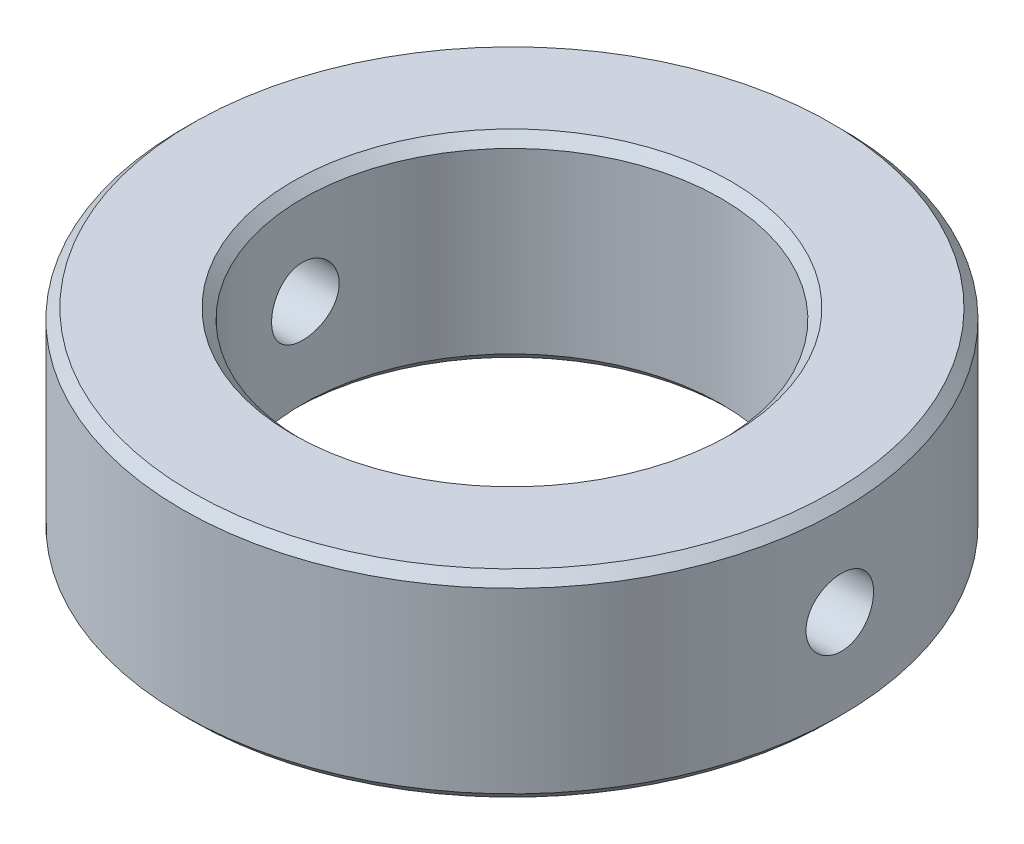
ISO-10303-21;
HEADER;
FILE_DESCRIPTION(('STEP AP214'),'2;1');
FILE_NAME('part.step','',(''),(''),'','','');
FILE_SCHEMA(('AUTOMOTIVE_DESIGN { 1 0 10303 214 1 1 1 1 }'));
ENDSEC;
DATA;
#1=APPLICATION_CONTEXT('core data for automotive mechanical design processes');
#2=APPLICATION_PROTOCOL_DEFINITION('international standard','automotive_design',2000,#1);
#3=PRODUCT_CONTEXT('',#1,'mechanical');
#4=PRODUCT('Part','Part','',(#3));
#5=PRODUCT_RELATED_PRODUCT_CATEGORY('part','',(#4));
#6=PRODUCT_DEFINITION_FORMATION('','',#4);
#7=PRODUCT_DEFINITION_CONTEXT('part definition',#1,'design');
#8=PRODUCT_DEFINITION('design','',#6,#7);
#9=PRODUCT_DEFINITION_SHAPE('','',#8);
#10=(LENGTH_UNIT() NAMED_UNIT(*) SI_UNIT(.MILLI.,.METRE.));
#11=(NAMED_UNIT(*) PLANE_ANGLE_UNIT() SI_UNIT($,.RADIAN.));
#12=(NAMED_UNIT(*) SI_UNIT($,.STERADIAN.) SOLID_ANGLE_UNIT());
#13=UNCERTAINTY_MEASURE_WITH_UNIT(LENGTH_MEASURE(1.E-05),#10,'distance_accuracy_value','');
#14=(GEOMETRIC_REPRESENTATION_CONTEXT(3) GLOBAL_UNCERTAINTY_ASSIGNED_CONTEXT((#13)) GLOBAL_UNIT_ASSIGNED_CONTEXT((#10,
#11,#12)) REPRESENTATION_CONTEXT('',''));
#15=CARTESIAN_POINT('',(0.,0.,0.));
#16=DIRECTION('',(0.,0.,1.));
#17=DIRECTION('',(1.,0.,0.));
#18=AXIS2_PLACEMENT_3D('',#15,#16,#17);
#19=CARTESIAN_POINT('',(0.,6.,0.));
#20=DIRECTION('',(0.,1.,0.));
#21=DIRECTION('',(0.,0.,1.));
#22=AXIS2_PLACEMENT_3D('',#19,#20,#21);
#23=PLANE('',#22);
#24=CARTESIAN_POINT('',(0.,6.,0.));
#25=DIRECTION('',(0.,1.,0.));
#26=DIRECTION('',(0.,0.,1.));
#27=AXIS2_PLACEMENT_3D('',#24,#25,#26);
#28=CIRCLE('',#27,9.7);
#29=CARTESIAN_POINT('',(0.,6.,9.7));
#30=VERTEX_POINT('',#29);
#31=EDGE_CURVE('E12',#30,#30,#28,.T.);
#32=ORIENTED_EDGE('',*,*,#31,.T.);
#33=EDGE_LOOP('',(#32));
#34=FACE_BOUND('',#33,.T.);
#35=CARTESIAN_POINT('',(0.,6.,0.));
#36=DIRECTION('',(0.,1.,0.));
#37=DIRECTION('',(0.,0.,1.));
#38=AXIS2_PLACEMENT_3D('',#35,#36,#37);
#39=CIRCLE('',#38,6.65);
#40=CARTESIAN_POINT('',(0.,6.,6.65));
#41=VERTEX_POINT('',#40);
#42=EDGE_CURVE('E55',#41,#41,#39,.F.);
#43=ORIENTED_EDGE('',*,*,#42,.T.);
#44=EDGE_LOOP('',(#43));
#45=FACE_BOUND('',#44,.T.);
#46=ADVANCED_FACE('F48',(#34,#45),#23,.T.);
#47=CARTESIAN_POINT('',(0.,0.,0.));
#48=DIRECTION('',(0.,1.,0.));
#49=DIRECTION('',(0.,0.,1.));
#50=AXIS2_PLACEMENT_3D('',#47,#48,#49);
#51=PLANE('',#50);
#52=CARTESIAN_POINT('',(0.,0.,0.));
#53=DIRECTION('',(0.,1.,0.));
#54=DIRECTION('',(0.,0.,1.));
#55=AXIS2_PLACEMENT_3D('',#52,#53,#54);
#56=CIRCLE('',#55,6.65);
#57=CARTESIAN_POINT('',(0.,0.,6.65));
#58=VERTEX_POINT('',#57);
#59=EDGE_CURVE('E74',#58,#58,#56,.T.);
#60=ORIENTED_EDGE('',*,*,#59,.T.);
#61=EDGE_LOOP('',(#60));
#62=FACE_BOUND('',#61,.T.);
#63=CARTESIAN_POINT('',(0.,0.,0.));
#64=DIRECTION('',(0.,1.,0.));
#65=DIRECTION('',(0.,0.,1.));
#66=AXIS2_PLACEMENT_3D('',#63,#64,#65);
#67=CIRCLE('',#66,9.7);
#68=CARTESIAN_POINT('',(0.,0.,9.7));
#69=VERTEX_POINT('',#68);
#70=EDGE_CURVE('E77',#69,#69,#67,.F.);
#71=ORIENTED_EDGE('',*,*,#70,.T.);
#72=EDGE_LOOP('',(#71));
#73=FACE_BOUND('',#72,.T.);
#74=ADVANCED_FACE('F121',(#62,#73),#51,.F.);
#75=CARTESIAN_POINT('',(0.,6.,0.));
#76=DIRECTION('',(0.,-1.,0.));
#77=DIRECTION('',(0.,0.,-1.));
#78=AXIS2_PLACEMENT_3D('',#75,#76,#77);
#79=CYLINDRICAL_SURFACE('',#78,10.);
#80=CARTESIAN_POINT('',(0.,0.299999999999995,0.));
#81=DIRECTION('',(0.,1.,0.));
#82=DIRECTION('',(0.,0.,1.));
#83=AXIS2_PLACEMENT_3D('',#80,#81,#82);
#84=CIRCLE('',#83,10.);
#85=CARTESIAN_POINT('',(0.,0.299999999999995,10.));
#86=VERTEX_POINT('',#85);
#87=EDGE_CURVE('E59',#86,#86,#84,.T.);
#88=ORIENTED_EDGE('',*,*,#87,.T.);
#89=EDGE_LOOP('',(#88));
#90=FACE_BOUND('',#89,.T.);
#91=CARTESIAN_POINT('',(0.,5.69999999999999,0.));
#92=DIRECTION('',(0.,1.,0.));
#93=DIRECTION('',(0.,0.,1.));
#94=AXIS2_PLACEMENT_3D('',#91,#92,#93);
#95=CIRCLE('',#94,10.);
#96=CARTESIAN_POINT('',(0.,5.69999999999999,10.));
#97=VERTEX_POINT('',#96);
#98=EDGE_CURVE('E63',#97,#97,#95,.F.);
#99=ORIENTED_EDGE('',*,*,#98,.T.);
#100=EDGE_LOOP('',(#99));
#101=FACE_BOUND('',#100,.T.);
#102=CARTESIAN_POINT('',(-10.,1.97500000000001,0.));
#103=CARTESIAN_POINT('',(-9.99999932441296,1.97500248238028,-0.0574131062054996));
#104=CARTESIAN_POINT('',(-9.99950030929872,1.97984004507992,-0.114863983907446));
#105=CARTESIAN_POINT('',(-9.99755762501469,1.9990647024074,-0.228172445244312));
#106=CARTESIAN_POINT('',(-9.99611292001963,2.0134622684683,-0.284028211643129));
#107=CARTESIAN_POINT('',(-9.99244190777641,2.05138292992313,-0.39248926527767));
#108=CARTESIAN_POINT('',(-9.99021607755955,2.07490045669731,-0.445096513369503));
#109=CARTESIAN_POINT('',(-9.9852315814176,2.1303825244494,-0.545605673014001));
#110=CARTESIAN_POINT('',(-9.98247302015676,2.16234540664414,-0.593508506046438));
#111=CARTESIAN_POINT('',(-9.97672034817429,2.23394018490046,-0.683441035563868));
#112=CARTESIAN_POINT('',(-9.97372547839951,2.27359744506658,-0.725450493185196));
#113=CARTESIAN_POINT('',(-9.96784399214136,2.35940111214278,-0.8022297925499));
#114=CARTESIAN_POINT('',(-9.96495738071386,2.40554782164456,-0.836999296519211));
#115=CARTESIAN_POINT('',(-9.95961151493231,2.50314760483241,-0.898383757314614));
#116=CARTESIAN_POINT('',(-9.95715322902171,2.5546122947672,-0.924980336165677));
#117=CARTESIAN_POINT('',(-9.95295182060713,2.66130666143287,-0.969146617542703));
#118=CARTESIAN_POINT('',(-9.95120867959267,2.71653624067193,-0.986716553713149));
#119=CARTESIAN_POINT('',(-9.9486418257013,2.82898583362562,-1.01227065402806));
#120=CARTESIAN_POINT('',(-9.94781488790261,2.88619813011058,-1.02028844808327));
#121=CARTESIAN_POINT('',(-9.94716407105467,3.00116186434615,-1.02661463441976));
#122=CARTESIAN_POINT('',(-9.94734016438832,3.05891328720893,-1.02492329402893));
#123=CARTESIAN_POINT('',(-9.94867256793449,3.17308387282555,-1.01190693074944));
#124=CARTESIAN_POINT('',(-9.94982513897765,3.22950727497071,-1.00061865626926));
#125=CARTESIAN_POINT('',(-9.95297479225768,3.33965447521571,-0.968786051282914));
#126=CARTESIAN_POINT('',(-9.95497188642203,3.39337823517562,-0.948241590048264));
#127=CARTESIAN_POINT('',(-9.95958986076258,3.4967170428138,-0.898439326613739));
#128=CARTESIAN_POINT('',(-9.96221190412126,3.54632419355445,-0.869165250651661));
#129=CARTESIAN_POINT('',(-9.96778336264656,3.63993519241195,-0.802746430394857));
#130=CARTESIAN_POINT('',(-9.97073278788102,3.68393886811776,-0.76560144401693));
#131=CARTESIAN_POINT('',(-9.97664334256132,3.76530733592978,-0.684290106939165));
#132=CARTESIAN_POINT('',(-9.97960446292742,3.8026404269832,-0.640092024909692));
#133=CARTESIAN_POINT('',(-9.98519187154236,3.86936216732988,-0.546039217664439));
#134=CARTESIAN_POINT('',(-9.98781815938634,3.89875080701734,-0.496184485609196));
#135=CARTESIAN_POINT('',(-9.99244091747177,3.94874825374905,-0.392211383657822));
#136=CARTESIAN_POINT('',(-9.99443726988248,3.96935541845237,-0.338092218453697));
#137=CARTESIAN_POINT('',(-9.99757403288948,4.00118154633689,-0.227137000902652));
#138=CARTESIAN_POINT('',(-9.99871447038201,4.01240080452464,-0.170301033988128));
#139=CARTESIAN_POINT('',(-10.0000074478558,4.02509235067408,-0.0558000710087554));
#140=CARTESIAN_POINT('',(-10.000164420832,4.02660837690576,0.00186002902332531));
#141=CARTESIAN_POINT('',(-9.99948467674765,4.01996535162462,0.11661348570182));
#142=CARTESIAN_POINT('',(-9.99864797380352,4.01180643755709,0.173706850387837));
#143=CARTESIAN_POINT('',(-9.99607772819907,3.98608142390921,0.285579670099533));
#144=CARTESIAN_POINT('',(-9.99434614145257,3.9685358374938,0.340363890840557));
#145=CARTESIAN_POINT('',(-9.99018035076137,3.92455663705304,0.446211523740552));
#146=CARTESIAN_POINT('',(-9.98774613031117,3.89812281423256,0.49727484845701));
#147=CARTESIAN_POINT('',(-9.98243622632233,3.83700926852691,0.594428726742531));
#148=CARTESIAN_POINT('',(-9.97955901906721,3.80230084897839,0.640501144374615));
#149=CARTESIAN_POINT('',(-9.97369079041989,3.72566445094606,0.726181716509853));
#150=CARTESIAN_POINT('',(-9.97069976602537,3.68373628191302,0.765789700344893));
#151=CARTESIAN_POINT('',(-9.96492764170355,3.59365956060607,0.837569245015072));
#152=CARTESIAN_POINT('',(-9.96214737972029,3.54548805140624,0.869712073931628));
#153=CARTESIAN_POINT('',(-9.95712440687486,3.44440512695985,0.925451287834751));
#154=CARTESIAN_POINT('',(-9.95488168834143,3.39149377937019,0.949047794788075));
#155=CARTESIAN_POINT('',(-9.95119300204058,3.28253114524049,0.986976588495294));
#156=CARTESIAN_POINT('',(-9.94974557171028,3.22648583281152,1.00132588964706));
#157=CARTESIAN_POINT('',(-9.94780683072443,3.11276569842616,1.02040811822004));
#158=CARTESIAN_POINT('',(-9.94731549113239,3.05509092583969,1.02514133667631));
#159=CARTESIAN_POINT('',(-9.94734519187248,2.94003464246843,1.02485288529927));
#160=CARTESIAN_POINT('',(-9.94786154813303,2.88265301199357,1.01987634933169));
#161=CARTESIAN_POINT('',(-9.94983846493521,2.76954560080201,1.00040437251341));
#162=CARTESIAN_POINT('',(-9.95129902646635,2.71381982182069,0.985908921686921));
#163=CARTESIAN_POINT('',(-9.95499847202916,2.60560681855819,0.947823195800995));
#164=CARTESIAN_POINT('',(-9.95723723596678,2.5531190960432,0.924234323998777));
#165=CARTESIAN_POINT('',(-9.96224107223369,2.45284063024732,0.868635982030915));
#166=CARTESIAN_POINT('',(-9.96500614248734,2.40504986844379,0.836626545073925));
#167=CARTESIAN_POINT('',(-9.97076643677678,2.31529064358951,0.764926345454402));
#168=CARTESIAN_POINT('',(-9.9737626328751,2.27334911621277,0.725201939983134));
#169=CARTESIAN_POINT('',(-9.97963872713512,2.19670780135904,0.639266514947733));
#170=CARTESIAN_POINT('',(-9.98251859731168,2.1620097482121,0.593053946320147));
#171=CARTESIAN_POINT('',(-9.98784548364804,2.10076788599113,0.495320291342239));
#172=CARTESIAN_POINT('',(-9.99029134156529,2.07424576103223,0.443785564179659));
#173=CARTESIAN_POINT('',(-9.99446213509582,2.030267096326,0.337001541441048));
#174=CARTESIAN_POINT('',(-9.9961878804826,2.01280036830759,0.281756499784522));
#175=CARTESIAN_POINT('',(-9.99829195450523,1.99176807922807,0.188500857891405));
#176=CARTESIAN_POINT('',(-9.9989294728254,1.98548868061638,0.151085725135666));
#177=CARTESIAN_POINT('',(-9.99978371764368,1.97710383078781,0.0757858804341505));
#178=CARTESIAN_POINT('',(-10.0000004459877,1.97499836126063,0.03790117054906));
#179=CARTESIAN_POINT('',(-10.,1.97500000000001,0.));
#180=B_SPLINE_CURVE_WITH_KNOTS('',3,(#102,#103,#104,#105,#106,#107,#108,#109,#110,#111,#112,
#113,#114,#115,#116,#117,#118,#119,#120,#121,#122,#123,#124,#125,#126,#127,#128,#129,#130,#131,
#132,#133,#134,#135,#136,#137,#138,#139,#140,#141,#142,#143,#144,#145,#146,#147,#148,#149,#150,
#151,#152,#153,#154,#155,#156,#157,#158,#159,#160,#161,#162,#163,#164,#165,#166,#167,#168,#169,
#170,#171,#172,#173,#174,#175,#176,#177,#178,#179),.UNSPECIFIED.,.T.,.F.,(4,2,2,2,2,2,2,2,2,2,2,
2,2,2,2,2,2,2,2,2,2,2,2,2,2,2,2,2,2,2,2,2,2,2,2,2,2,2,4),(0.,0.172100914190093,
0.344390648668409,0.516575348790347,0.688726254592383,0.861454595929419,1.0341909939601,
1.20731301883546,1.3804305624163,1.55293679847462,1.72543828482955,1.89728219134573,
2.06912852495196,2.24129723906117,2.41347124928003,2.58644290698912,2.7594147738407,
2.93241897628896,3.10541774203104,3.27763614640245,3.44985210421376,3.62169323808444,
3.79353840898747,3.96598844548515,4.13844303411596,4.31155075624403,4.48465600780991,
4.65744183803423,4.83022243874012,5.00220181627841,5.17418137405068,5.34613440330152,
5.51808675442172,5.69080649698256,5.86356754711598,6.03678292669601,6.20980299554591,
6.32341563813141,6.4370277823171),.UNSPECIFIED.);
#181=CARTESIAN_POINT('',(-10.,1.97500000000001,0.));
#182=VERTEX_POINT('',#181);
#183=EDGE_CURVE('E80',#182,#182,#180,.T.);
#184=ORIENTED_EDGE('',*,*,#183,.T.);
#185=EDGE_LOOP('',(#184));
#186=FACE_BOUND('',#185,.T.);
#187=CARTESIAN_POINT('',(9.94733004378562,3.,-1.02499999999999));
#188=CARTESIAN_POINT('',(9.94733073271221,2.94258778704536,-1.02499751682201));
#189=CARTESIAN_POINT('',(9.94783244369606,2.8851377998052,-1.02016009956435));
#190=CARTESIAN_POINT('',(9.94978475756248,2.77183118858083,-1.00093607245135));
#191=CARTESIAN_POINT('',(9.95123640126126,2.71597638253283,-0.986538988066416));
#192=CARTESIAN_POINT('',(9.95492246268471,2.60751735966208,-0.948619735638883));
#193=CARTESIAN_POINT('',(9.9571564006731,2.55491117385177,-0.925103159111542));
#194=CARTESIAN_POINT('',(9.96215475293021,2.45440379444059,-0.869623329191587));
#195=CARTESIAN_POINT('',(9.96491906313967,2.40650168068138,-0.837661732252513));
#196=CARTESIAN_POINT('',(9.97067849810918,2.31656834026009,-0.766068252842936));
#197=CARTESIAN_POINT('',(9.97367437402758,2.27455757997983,-0.72641071907521));
#198=CARTESIAN_POINT('',(9.97955256819695,2.19777576609285,-0.640605957667765));
#199=CARTESIAN_POINT('',(9.98243488120751,2.1630050462639,-0.594458430992951));
#200=CARTESIAN_POINT('',(9.9877686378977,2.10161931301852,-0.496857930535651));
#201=CARTESIAN_POINT('',(9.99021911735966,2.07502245455524,-0.445393481038132));
#202=CARTESIAN_POINT('',(9.99440492171602,2.03085558992541,-0.338699636920603));
#203=CARTESIAN_POINT('',(9.99614026485906,2.01328535341699,-0.283470338412973));
#204=CARTESIAN_POINT('',(9.99869499627109,1.98773062702973,-0.1710216101229));
#205=CARTESIAN_POINT('',(9.9995175998611,1.97971248046039,-0.113809903256693));
#206=CARTESIAN_POINT('',(10.0001651063528,1.97338538480378,0.00115267613459642));
#207=CARTESIAN_POINT('',(9.99999003633151,1.97507617221472,0.0589035339845795));
#208=CARTESIAN_POINT('',(9.99866455028414,1.9880916591247,0.173076555973622));
#209=CARTESIAN_POINT('',(9.99751779839636,1.99938016689558,0.229502894377627));
#210=CARTESIAN_POINT('',(9.99438201947863,2.03121425590454,0.339655846658382));
#211=CARTESIAN_POINT('',(9.99239298103469,2.05175996258905,0.393382423939078));
#212=CARTESIAN_POINT('',(9.98778993647089,2.1015648066005,0.496724650158245));
#213=CARTESIAN_POINT('',(9.98517478569171,2.13083992739895,0.546332542956332));
#214=CARTESIAN_POINT('',(9.97961288115049,2.19726097861112,0.639944582983853));
#215=CARTESIAN_POINT('',(9.9766661171687,2.23440715162834,0.683948557420994));
#216=CARTESIAN_POINT('',(9.97075560135797,2.31571933145095,0.765315688113216));
#217=CARTESIAN_POINT('',(9.96779183371358,2.35991682704711,0.802647382816084));
#218=CARTESIAN_POINT('',(9.96219485203432,2.45396796308729,0.869366585105703));
#219=CARTESIAN_POINT('',(9.95956163851966,2.50382161243226,0.898754080190606));
#220=CARTESIAN_POINT('',(9.95492369445158,2.60779441892733,0.948750703123733));
#221=CARTESIAN_POINT('',(9.95291910678796,2.66191454237495,0.969357835532979));
#222=CARTESIAN_POINT('',(9.94976831062804,2.77287184311313,1.00118360528627));
#223=CARTESIAN_POINT('',(9.94862207462698,2.82970893327992,1.0124025434642));
#224=CARTESIAN_POINT('',(9.94732254691701,2.9442104221719,1.0250928823608));
#225=CARTESIAN_POINT('',(9.94716476927623,3.001869891238,1.0266083212739));
#226=CARTESIAN_POINT('',(9.94784818174958,3.11662194496953,1.0199643465672));
#227=CARTESIAN_POINT('',(9.94868935766942,3.17371453767817,1.01180507041705));
#228=CARTESIAN_POINT('',(9.9512718151954,3.28558350005335,0.986080143490705));
#229=CARTESIAN_POINT('',(9.95301109961531,3.34036471850418,0.968535360815071));
#230=CARTESIAN_POINT('',(9.95719217920946,3.44620670232278,0.924558773122261));
#231=CARTESIAN_POINT('',(9.95963399126359,3.49726737825874,0.898126754565563));
#232=CARTESIAN_POINT('',(9.96495584306212,3.59441944566002,0.837015867959792));
#233=CARTESIAN_POINT('',(9.96783741880006,3.64049241253252,0.802307844949529));
#234=CARTESIAN_POINT('',(9.97370910707739,3.72617427749889,0.725671918779973));
#235=CARTESIAN_POINT('',(9.97669922243937,3.76578300734173,0.683743827755246));
#236=CARTESIAN_POINT('',(9.98246464114521,3.83756417282179,0.59366678205168));
#237=CARTESIAN_POINT('',(9.98523908755331,3.86970786091594,0.545494856340168));
#238=CARTESIAN_POINT('',(9.9902480568513,3.92544858214797,0.444410868933816));
#239=CARTESIAN_POINT('',(9.99248258746354,3.94904573752835,0.391498875050471));
#240=CARTESIAN_POINT('',(9.99615608909044,3.9869749581459,0.282536641786548));
#241=CARTESIAN_POINT('',(9.99759654446308,4.00132431875757,0.22649247492183));
#242=CARTESIAN_POINT('',(9.99952569213442,4.02040705439161,0.112774757267382));
#243=CARTESIAN_POINT('',(10.0000144126322,4.02514071431898,0.0551012548048124));
#244=CARTESIAN_POINT('',(9.99998499987337,4.02485355449135,-0.0599557794139817));
#245=CARTESIAN_POINT('',(9.99947147022781,4.01987733491115,-0.117339428865408));
#246=CARTESIAN_POINT('',(9.9975043473173,4.00040528079934,-0.230450957226819));
#247=CARTESIAN_POINT('',(9.99605075341888,3.9859094398528,-0.286178835021013));
#248=CARTESIAN_POINT('',(9.99236633782405,3.9478221377559,-0.3943960585714));
#249=CARTESIAN_POINT('',(9.99013563423961,3.92423205876979,-0.446885895047364));
#250=CARTESIAN_POINT('',(9.98514550735364,3.86863064768543,-0.547168085278382));
#251=CARTESIAN_POINT('',(9.98238608628464,3.83661935114572,-0.59496045886728));
#252=CARTESIAN_POINT('',(9.97663240200453,3.76491710155134,-0.684719600898477));
#253=CARTESIAN_POINT('',(9.97363715758882,3.72519293131162,-0.726659772209177));
#254=CARTESIAN_POINT('',(9.9677576734454,3.63925853535156,-0.803298460911361));
#255=CARTESIAN_POINT('',(9.96487346049227,3.59304675751277,-0.837995240413035));
#256=CARTESIAN_POINT('',(9.95953439999139,3.49531375155006,-0.89923572647049));
#257=CARTESIAN_POINT('',(9.95708071383225,3.44377874014176,-0.925757521554618));
#258=CARTESIAN_POINT('',(9.95289433027227,3.33699411546254,-0.969735490879905));
#259=CARTESIAN_POINT('',(9.95116082268514,3.28174875801158,-0.987201857810963));
#260=CARTESIAN_POINT('',(9.94904678444611,3.18849408147398,-1.00823313318002));
#261=CARTESIAN_POINT('',(9.94840606552508,3.15108030149035,-1.01451207550249));
#262=CARTESIAN_POINT('',(9.94754746874749,3.07578316667588,-1.02289631920185));
#263=CARTESIAN_POINT('',(9.94732958900103,3.03789981394455,-1.0250016392328));
#264=CARTESIAN_POINT('',(9.94733004378562,3.,-1.02499999999999));
#265=B_SPLINE_CURVE_WITH_KNOTS('',3,(#187,#188,#189,#190,#191,#192,#193,#194,#195,#196,#197,
#198,#199,#200,#201,#202,#203,#204,#205,#206,#207,#208,#209,#210,#211,#212,#213,#214,#215,#216,
#217,#218,#219,#220,#221,#222,#223,#224,#225,#226,#227,#228,#229,#230,#231,#232,#233,#234,#235,
#236,#237,#238,#239,#240,#241,#242,#243,#244,#245,#246,#247,#248,#249,#250,#251,#252,#253,#254,
#255,#256,#257,#258,#259,#260,#261,#262,#263,#264),.UNSPECIFIED.,.T.,.F.,(4,2,2,2,2,2,2,2,2,2,2,
2,2,2,2,2,2,2,2,2,2,2,2,2,2,2,2,2,2,2,2,2,2,2,2,2,2,2,4),(0.,0.172098231037394,
0.344385342001959,0.516566983636833,0.688714877640169,0.861446730283829,1.03418654438752,
1.20730730309341,1.38042364387418,1.55292818968952,1.72542805373044,1.89728031403591,
2.06913490322107,2.24130610910459,2.41348262246339,2.58645072414439,2.75941909802506,
2.93242676003007,3.10542887799122,3.27764528627652,3.4498592475393,3.62169188346558,
3.79352864842385,3.96597994929774,4.1384357380151,4.31154502370313,4.48465183328218,
4.6574339489537,4.83021094516396,5.0021961965675,5.1741815638659,5.34614080271129,
5.51809931547125,5.69081552505602,5.86357312652602,6.0367898238836,6.20981112481496,
6.32341970656767,6.43702778054415),.UNSPECIFIED.);
#266=CARTESIAN_POINT('',(9.94733004378562,3.,-1.02499999999999));
#267=VERTEX_POINT('',#266);
#268=EDGE_CURVE('E89',#267,#267,#265,.T.);
#269=ORIENTED_EDGE('',*,*,#268,.T.);
#270=EDGE_LOOP('',(#269));
#271=FACE_BOUND('',#270,.T.);
#272=ADVANCED_FACE('F116',(#90,#101,#186,#271),#79,.T.);
#273=CARTESIAN_POINT('',(0.,6.,0.));
#274=DIRECTION('',(0.,-1.,0.));
#275=DIRECTION('',(0.,0.,-1.));
#276=AXIS2_PLACEMENT_3D('',#273,#274,#275);
#277=CYLINDRICAL_SURFACE('',#276,6.35);
#278=CARTESIAN_POINT('',(0.,0.300000000000002,0.));
#279=DIRECTION('',(0.,1.,0.));
#280=DIRECTION('',(0.,0.,1.));
#281=AXIS2_PLACEMENT_3D('',#278,#279,#280);
#282=CIRCLE('',#281,6.35);
#283=CARTESIAN_POINT('',(0.,0.300000000000002,6.35));
#284=VERTEX_POINT('',#283);
#285=EDGE_CURVE('E68',#284,#284,#282,.F.);
#286=ORIENTED_EDGE('',*,*,#285,.T.);
#287=EDGE_LOOP('',(#286));
#288=FACE_BOUND('',#287,.T.);
#289=CARTESIAN_POINT('',(0.,5.7,0.));
#290=DIRECTION('',(0.,1.,0.));
#291=DIRECTION('',(0.,0.,1.));
#292=AXIS2_PLACEMENT_3D('',#289,#290,#291);
#293=CIRCLE('',#292,6.35);
#294=CARTESIAN_POINT('',(0.,5.7,6.35));
#295=VERTEX_POINT('',#294);
#296=EDGE_CURVE('E71',#295,#295,#293,.T.);
#297=ORIENTED_EDGE('',*,*,#296,.T.);
#298=EDGE_LOOP('',(#297));
#299=FACE_BOUND('',#298,.T.);
#300=CARTESIAN_POINT('',(-6.26672761495184,3.,-1.02499999999999));
#301=CARTESIAN_POINT('',(-6.2667286244408,3.05717085527646,-1.02499768050555));
#302=CARTESIAN_POINT('',(-6.2675184376362,3.11437357314964,-1.02020062858655));
#303=CARTESIAN_POINT('',(-6.27058971428904,3.22717585518954,-1.00114644621389));
#304=CARTESIAN_POINT('',(-6.272872579175,3.28277386187597,-0.986880427682655));
#305=CARTESIAN_POINT('',(-6.27866481763677,3.39071780354782,-0.949329524829549));
#306=CARTESIAN_POINT('',(-6.28217319329289,3.44306634381517,-0.926051976830302));
#307=CARTESIAN_POINT('',(-6.29001996620215,3.54310850792799,-0.871156737158881));
#308=CARTESIAN_POINT('',(-6.29435826325769,3.59080269265184,-0.839540052108321));
#309=CARTESIAN_POINT('',(-6.30342092484404,3.68062983173385,-0.768551846694021));
#310=CARTESIAN_POINT('',(-6.30814818846919,3.72271347164535,-0.729118286590537));
#311=CARTESIAN_POINT('',(-6.31743034713052,3.79969690568682,-0.643749748953092));
#312=CARTESIAN_POINT('',(-6.32198523218359,3.83459628426626,-0.597814395602974));
#313=CARTESIAN_POINT('',(-6.33043999306187,3.89640462457597,-0.500427814588273));
#314=CARTESIAN_POINT('',(-6.33433606624021,3.92326784341912,-0.448947196984627));
#315=CARTESIAN_POINT('',(-6.34100200799423,3.96794745238042,-0.34213099447262));
#316=CARTESIAN_POINT('',(-6.34377194530546,3.98576439466932,-0.286795645085651));
#317=CARTESIAN_POINT('',(-6.34785305662322,4.01169528636582,-0.174349749799978));
#318=CARTESIAN_POINT('',(-6.34917666820254,4.01989201017525,-0.117258751072657));
#319=CARTESIAN_POINT('',(-6.35025869137832,4.0266070619151,-0.0024974512131184));
#320=CARTESIAN_POINT('',(-6.350017203053,4.02512600867793,0.0551728126433225));
#321=CARTESIAN_POINT('',(-6.34800611117258,4.0125923513746,0.168890041165964));
#322=CARTESIAN_POINT('',(-6.34625072851001,4.00162881901653,0.224947110490997));
#323=CARTESIAN_POINT('',(-6.34142493179842,3.97058152998279,0.334415329540568));
#324=CARTESIAN_POINT('',(-6.33835447966899,3.95049750920451,0.387826402595137));
#325=CARTESIAN_POINT('',(-6.3312192489182,3.90168996824283,0.49075291110772));
#326=CARTESIAN_POINT('',(-6.32715023060625,3.87292948709775,0.540250513869565));
#327=CARTESIAN_POINT('',(-6.31847040645189,3.80761247753779,0.633750638250302));
#328=CARTESIAN_POINT('',(-6.31385955943096,3.77105535641256,0.677752741690974));
#329=CARTESIAN_POINT('',(-6.30454737892875,3.69068804806749,0.759538681160378));
#330=CARTESIAN_POINT('',(-6.29984561287801,3.64680003686463,0.797246034151651));
#331=CARTESIAN_POINT('',(-6.29093241589207,3.55327969687078,0.864773409981799));
#332=CARTESIAN_POINT('',(-6.2867209889539,3.50364732126096,0.894593368528766));
#333=CARTESIAN_POINT('',(-6.2792651904519,3.39996136410076,0.945512972516904));
#334=CARTESIAN_POINT('',(-6.2760217922271,3.34590340179596,0.966603849173656));
#335=CARTESIAN_POINT('',(-6.27088573456426,3.23494811073027,0.999384838611737));
#336=CARTESIAN_POINT('',(-6.2689929640011,3.17805101597591,1.0110757248028));
#337=CARTESIAN_POINT('',(-6.26679383552199,3.06371562723907,1.02461808996991));
#338=CARTESIAN_POINT('',(-6.26646993202503,3.00629054972627,1.02657839801645));
#339=CARTESIAN_POINT('',(-6.26739852707002,2.89193252960385,1.0208935696631));
#340=CARTESIAN_POINT('',(-6.26865096865268,2.83499956928701,1.01324878033158));
#341=CARTESIAN_POINT('',(-6.27257495507452,2.7235848133828,0.988663395846931));
#342=CARTESIAN_POINT('',(-6.27523809886645,2.6690905567025,0.971777812176688));
#343=CARTESIAN_POINT('',(-6.28167641089111,2.5637054276594,0.929247700130266));
#344=CARTESIAN_POINT('',(-6.2854516419115,2.51281475895388,0.903602677189369));
#345=CARTESIAN_POINT('',(-6.29372970887364,2.41559591200555,0.844023299073257));
#346=CARTESIAN_POINT('',(-6.29823857195173,2.36931113718109,0.810018972510008));
#347=CARTESIAN_POINT('',(-6.30745807062422,2.28306582818686,0.734782683555343));
#348=CARTESIAN_POINT('',(-6.31216871948279,2.24310571057449,0.693550245479444));
#349=CARTESIAN_POINT('',(-6.32131630242454,2.17024877489697,0.604546943887079));
#350=CARTESIAN_POINT('',(-6.32575013096054,2.13742438714954,0.556716422685624));
#351=CARTESIAN_POINT('',(-6.3337951964197,2.08027712641093,0.456156770392659));
#352=CARTESIAN_POINT('',(-6.33740645865403,2.05595399181557,0.403427790101825));
#353=CARTESIAN_POINT('',(-6.34338596718873,2.01661338043193,0.294786736963345));
#354=CARTESIAN_POINT('',(-6.34575934376557,2.00155744923531,0.238888883475708));
#355=CARTESIAN_POINT('',(-6.34901730584076,1.9810545903261,0.125316851191615));
#356=CARTESIAN_POINT('',(-6.34990200592921,1.97560692302091,0.067642809464347));
#357=CARTESIAN_POINT('',(-6.3500814673984,1.97449546206659,-0.0471442600614563));
#358=CARTESIAN_POINT('',(-6.34939417017186,1.97872126441984,-0.104256221096545));
#359=CARTESIAN_POINT('',(-6.34654334088682,1.99659869058997,-0.216945764295097));
#360=CARTESIAN_POINT('',(-6.34437981587478,2.01025026941488,-0.272523353781244));
#361=CARTESIAN_POINT('',(-6.3388186639443,2.04655038845752,-0.380528190254298));
#362=CARTESIAN_POINT('',(-6.33542224760055,2.06919010526808,-0.432958468933137));
#363=CARTESIAN_POINT('',(-6.32776682018002,2.12281172964869,-0.533293379755665));
#364=CARTESIAN_POINT('',(-6.3235077723474,2.15379399270448,-0.581197818930461));
#365=CARTESIAN_POINT('',(-6.31454195237291,2.22361520465209,-0.671678656594732));
#366=CARTESIAN_POINT('',(-6.3098308497109,2.26253522780212,-0.714192069971574));
#367=CARTESIAN_POINT('',(-6.30052253410807,2.34695678488899,-0.792123812331003));
#368=CARTESIAN_POINT('',(-6.29592534810716,2.39245985856254,-0.827540476790833));
#369=CARTESIAN_POINT('',(-6.28733273209614,2.48911089367524,-0.890486348419713));
#370=CARTESIAN_POINT('',(-6.28334146675546,2.54029407462617,-0.917962046099161));
#371=CARTESIAN_POINT('',(-6.27646166948478,2.64659165608128,-0.963884173850521));
#372=CARTESIAN_POINT('',(-6.27357202258215,2.70170201436734,-0.982339738766363));
#373=CARTESIAN_POINT('',(-6.26987226109869,2.79753168439293,-1.0056305066061));
#374=CARTESIAN_POINT('',(-6.26869947555415,2.8376667960172,-1.01288259095077));
#375=CARTESIAN_POINT('',(-6.26712679908669,2.91852921735889,-1.02256812476513));
#376=CARTESIAN_POINT('',(-6.26672689552767,2.95925651738344,-1.02500165301499));
#377=CARTESIAN_POINT('',(-6.26672761495184,3.,-1.02499999999999));
#378=B_SPLINE_CURVE_WITH_KNOTS('',3,(#300,#301,#302,#303,#304,#305,#306,#307,#308,#309,#310,
#311,#312,#313,#314,#315,#316,#317,#318,#319,#320,#321,#322,#323,#324,#325,#326,#327,#328,#329,
#330,#331,#332,#333,#334,#335,#336,#337,#338,#339,#340,#341,#342,#343,#344,#345,#346,#347,#348,
#349,#350,#351,#352,#353,#354,#355,#356,#357,#358,#359,#360,#361,#362,#363,#364,#365,#366,#367,
#368,#369,#370,#371,#372,#373,#374,#375,#376,#377),.UNSPECIFIED.,.T.,.F.,(4,2,2,2,2,2,2,2,2,2,2,
2,2,2,2,2,2,2,2,2,2,2,2,2,2,2,2,2,2,2,2,2,2,2,2,2,2,2,4),(0.,0.171363597411835,
0.342888273748035,0.514273603805661,0.685638255310568,0.858421741972913,1.03121521993479,
1.20497432308264,1.37872281896783,1.55096512377394,1.72319641488603,1.89382724345565,
2.06446301330882,2.23583619453725,2.4072224084166,2.58055948851084,2.75389798147064,
2.92741018114569,3.10090810317212,3.27246114174724,3.4440079816426,3.61454452081106,
3.78509069019651,3.9571161598265,4.12915295476428,4.30286194028621,4.47656557989086,
4.64954348670124,4.82250807801936,4.99350846817164,5.1645080420953,5.33534016389418,
5.50617956620357,5.67886013209325,5.85158115244392,6.02544026099359,6.19912293270565,
6.32124921315971,6.44337349691403),.UNSPECIFIED.);
#379=CARTESIAN_POINT('',(-6.26672761495184,3.,-1.02499999999999));
#380=VERTEX_POINT('',#379);
#381=EDGE_CURVE('E81',#380,#380,#378,.T.);
#382=ORIENTED_EDGE('',*,*,#381,.F.);
#383=EDGE_LOOP('',(#382));
#384=FACE_BOUND('',#383,.T.);
#385=CARTESIAN_POINT('',(6.26672761495184,3.,-1.02499999999999));
#386=CARTESIAN_POINT('',(6.2667286244408,2.94282914472354,-1.02499768050555));
#387=CARTESIAN_POINT('',(6.2675184376362,2.88562642685036,-1.02020062858655));
#388=CARTESIAN_POINT('',(6.27058971428904,2.77282414481046,-1.00114644621389));
#389=CARTESIAN_POINT('',(6.272872579175,2.71722613812403,-0.986880427682655));
#390=CARTESIAN_POINT('',(6.27866481763677,2.60928219645218,-0.949329524829548));
#391=CARTESIAN_POINT('',(6.28217319329289,2.55693365618483,-0.926051976830302));
#392=CARTESIAN_POINT('',(6.29001996620215,2.45689149207201,-0.871156737158881));
#393=CARTESIAN_POINT('',(6.29435826325769,2.40919730734816,-0.839540052108321));
#394=CARTESIAN_POINT('',(6.30342092484404,2.31937016826615,-0.768551846694021));
#395=CARTESIAN_POINT('',(6.30814818846919,2.27728652835465,-0.729118286590537));
#396=CARTESIAN_POINT('',(6.31743034713052,2.20030309431318,-0.643749748953092));
#397=CARTESIAN_POINT('',(6.32198523218359,2.16540371573374,-0.597814395602974));
#398=CARTESIAN_POINT('',(6.33043999306187,2.10359537542403,-0.500427814588273));
#399=CARTESIAN_POINT('',(6.33433606624021,2.07673215658088,-0.448947196984627));
#400=CARTESIAN_POINT('',(6.34100200799423,2.03205254761958,-0.34213099447262));
#401=CARTESIAN_POINT('',(6.34377194530546,2.01423560533068,-0.286795645085651));
#402=CARTESIAN_POINT('',(6.34785305662322,1.98830471363417,-0.174349749799978));
#403=CARTESIAN_POINT('',(6.34917666820254,1.98010798982476,-0.117258751072657));
#404=CARTESIAN_POINT('',(6.35025869137832,1.9733929380849,-0.00249745121311814));
#405=CARTESIAN_POINT('',(6.350017203053,1.97487399132208,0.0551728126433227));
#406=CARTESIAN_POINT('',(6.34800611117258,1.9874076486254,0.168890041165964));
#407=CARTESIAN_POINT('',(6.34625072851001,1.99837118098347,0.224947110490997));
#408=CARTESIAN_POINT('',(6.34142493179842,2.02941847001721,0.334415329540568));
#409=CARTESIAN_POINT('',(6.33835447966899,2.04950249079549,0.387826402595137));
#410=CARTESIAN_POINT('',(6.3312192489182,2.09831003175717,0.49075291110772));
#411=CARTESIAN_POINT('',(6.32715023060625,2.12707051290225,0.540250513869565));
#412=CARTESIAN_POINT('',(6.31847040645189,2.19238752246221,0.633750638250302));
#413=CARTESIAN_POINT('',(6.31385955943095,2.22894464358744,0.677752741690974));
#414=CARTESIAN_POINT('',(6.30454737892875,2.30931195193251,0.759538681160378));
#415=CARTESIAN_POINT('',(6.29984561287801,2.35319996313538,0.797246034151651));
#416=CARTESIAN_POINT('',(6.29093241589207,2.44672030312922,0.864773409981799));
#417=CARTESIAN_POINT('',(6.2867209889539,2.49635267873904,0.894593368528766));
#418=CARTESIAN_POINT('',(6.2792651904519,2.60003863589924,0.945512972516904));
#419=CARTESIAN_POINT('',(6.2760217922271,2.65409659820404,0.966603849173656));
#420=CARTESIAN_POINT('',(6.27088573456426,2.76505188926973,0.999384838611737));
#421=CARTESIAN_POINT('',(6.2689929640011,2.82194898402409,1.0110757248028));
#422=CARTESIAN_POINT('',(6.266793835522,2.93628437276093,1.02461808996991));
#423=CARTESIAN_POINT('',(6.26646993202503,2.99370945027373,1.02657839801645));
#424=CARTESIAN_POINT('',(6.26739852707002,3.10806747039615,1.0208935696631));
#425=CARTESIAN_POINT('',(6.26865096865268,3.16500043071299,1.01324878033158));
#426=CARTESIAN_POINT('',(6.27257495507452,3.2764151866172,0.988663395846931));
#427=CARTESIAN_POINT('',(6.27523809886645,3.3309094432975,0.971777812176688));
#428=CARTESIAN_POINT('',(6.28167641089111,3.4362945723406,0.929247700130266));
#429=CARTESIAN_POINT('',(6.28545164191149,3.48718524104612,0.903602677189369));
#430=CARTESIAN_POINT('',(6.29372970887364,3.58440408799445,0.844023299073257));
#431=CARTESIAN_POINT('',(6.29823857195173,3.63068886281891,0.810018972510008));
#432=CARTESIAN_POINT('',(6.30745807062422,3.71693417181314,0.734782683555343));
#433=CARTESIAN_POINT('',(6.31216871948279,3.75689428942551,0.693550245479444));
#434=CARTESIAN_POINT('',(6.32131630242454,3.82975122510303,0.604546943887079));
#435=CARTESIAN_POINT('',(6.32575013096054,3.86257561285046,0.556716422685624));
#436=CARTESIAN_POINT('',(6.3337951964197,3.91972287358907,0.456156770392659));
#437=CARTESIAN_POINT('',(6.33740645865403,3.94404600818443,0.403427790101825));
#438=CARTESIAN_POINT('',(6.34338596718873,3.98338661956807,0.294786736963345));
#439=CARTESIAN_POINT('',(6.34575934376557,3.99844255076469,0.238888883475707));
#440=CARTESIAN_POINT('',(6.34901730584076,4.0189454096739,0.125316851191614));
#441=CARTESIAN_POINT('',(6.34990200592921,4.02439307697909,0.067642809464347));
#442=CARTESIAN_POINT('',(6.3500814673984,4.02550453793341,-0.0471442600614562));
#443=CARTESIAN_POINT('',(6.34939417017186,4.02127873558016,-0.104256221096545));
#444=CARTESIAN_POINT('',(6.34654334088682,4.00340130941003,-0.216945764295098));
#445=CARTESIAN_POINT('',(6.34437981587478,3.98974973058512,-0.272523353781244));
#446=CARTESIAN_POINT('',(6.3388186639443,3.95344961154248,-0.380528190254298));
#447=CARTESIAN_POINT('',(6.33542224760055,3.93080989473192,-0.432958468933136));
#448=CARTESIAN_POINT('',(6.32776682018002,3.87718827035131,-0.533293379755664));
#449=CARTESIAN_POINT('',(6.3235077723474,3.84620600729552,-0.581197818930461));
#450=CARTESIAN_POINT('',(6.31454195237291,3.77638479534791,-0.671678656594731));
#451=CARTESIAN_POINT('',(6.3098308497109,3.73746477219788,-0.714192069971573));
#452=CARTESIAN_POINT('',(6.30052253410807,3.65304321511102,-0.792123812331003));
#453=CARTESIAN_POINT('',(6.29592534810716,3.60754014143746,-0.827540476790833));
#454=CARTESIAN_POINT('',(6.28733273209614,3.51088910632476,-0.890486348419712));
#455=CARTESIAN_POINT('',(6.28334146675546,3.45970592537383,-0.91796204609916));
#456=CARTESIAN_POINT('',(6.27646166948478,3.35340834391872,-0.963884173850521));
#457=CARTESIAN_POINT('',(6.27357202258215,3.29829798563266,-0.982339738766363));
#458=CARTESIAN_POINT('',(6.26987226109869,3.20246831560707,-1.0056305066061));
#459=CARTESIAN_POINT('',(6.26869947555415,3.1623332039828,-1.01288259095077));
#460=CARTESIAN_POINT('',(6.26712679908669,3.08147078264111,-1.02256812476513));
#461=CARTESIAN_POINT('',(6.26672689552767,3.04074348261656,-1.02500165301499));
#462=CARTESIAN_POINT('',(6.26672761495184,3.,-1.02499999999999));
#463=B_SPLINE_CURVE_WITH_KNOTS('',3,(#385,#386,#387,#388,#389,#390,#391,#392,#393,#394,#395,
#396,#397,#398,#399,#400,#401,#402,#403,#404,#405,#406,#407,#408,#409,#410,#411,#412,#413,#414,
#415,#416,#417,#418,#419,#420,#421,#422,#423,#424,#425,#426,#427,#428,#429,#430,#431,#432,#433,
#434,#435,#436,#437,#438,#439,#440,#441,#442,#443,#444,#445,#446,#447,#448,#449,#450,#451,#452,
#453,#454,#455,#456,#457,#458,#459,#460,#461,#462),.UNSPECIFIED.,.T.,.F.,(4,2,2,2,2,2,2,2,2,2,2,
2,2,2,2,2,2,2,2,2,2,2,2,2,2,2,2,2,2,2,2,2,2,2,2,2,2,2,4),(0.,0.171363597411835,
0.342888273748035,0.514273603805662,0.685638255310568,0.858421741972913,1.03121521993479,
1.20497432308264,1.37872281896783,1.55096512377394,1.72319641488603,1.89382724345565,
2.06446301330882,2.23583619453725,2.4072224084166,2.58055948851084,2.75389798147064,
2.92741018114569,3.10090810317212,3.27246114174724,3.4440079816426,3.61454452081106,
3.78509069019651,3.9571161598265,4.12915295476428,4.30286194028621,4.47656557989086,
4.64954348670124,4.82250807801936,4.99350846817164,5.1645080420953,5.33534016389417,
5.50617956620357,5.67886013209325,5.85158115244392,6.02544026099359,6.19912293270565,
6.32124921315971,6.44337349691403),.UNSPECIFIED.);
#464=CARTESIAN_POINT('',(6.26672761495184,3.,-1.02499999999999));
#465=VERTEX_POINT('',#464);
#466=EDGE_CURVE('E90',#465,#465,#463,.T.);
#467=ORIENTED_EDGE('',*,*,#466,.F.);
#468=EDGE_LOOP('',(#467));
#469=FACE_BOUND('',#468,.T.);
#470=ADVANCED_FACE('F95',(#288,#299,#384,#469),#277,.F.);
#471=CARTESIAN_POINT('',(10.,3.,0.));
#472=DIRECTION('',(1.,0.,0.));
#473=DIRECTION('',(0.,0.,-1.));
#474=AXIS2_PLACEMENT_3D('',#471,#472,#473);
#475=CYLINDRICAL_SURFACE('',#474,1.02499999999999);
#476=ORIENTED_EDGE('',*,*,#466,.T.);
#477=EDGE_LOOP('',(#476));
#478=FACE_BOUND('',#477,.T.);
#479=ORIENTED_EDGE('',*,*,#268,.F.);
#480=EDGE_LOOP('',(#479));
#481=FACE_BOUND('',#480,.T.);
#482=ADVANCED_FACE('F102',(#478,#481),#475,.F.);
#483=ORIENTED_EDGE('',*,*,#381,.T.);
#484=EDGE_LOOP('',(#483));
#485=FACE_BOUND('',#484,.T.);
#486=ORIENTED_EDGE('',*,*,#183,.F.);
#487=EDGE_LOOP('',(#486));
#488=FACE_BOUND('',#487,.T.);
#489=ADVANCED_FACE('F98',(#485,#488),#475,.F.);
#490=CARTESIAN_POINT('',(0.,0.,0.));
#491=DIRECTION('',(0.,-1.,0.));
#492=DIRECTION('',(0.,0.,-1.));
#493=AXIS2_PLACEMENT_3D('',#490,#491,#492);
#494=CONICAL_SURFACE('',#493,6.65,0.785398163397448);
#495=ORIENTED_EDGE('',*,*,#285,.F.);
#496=EDGE_LOOP('',(#495));
#497=FACE_BOUND('',#496,.T.);
#498=ORIENTED_EDGE('',*,*,#59,.F.);
#499=EDGE_LOOP('',(#498));
#500=FACE_BOUND('',#499,.T.);
#501=ADVANCED_FACE('F101',(#497,#500),#494,.F.);
#502=CARTESIAN_POINT('',(0.,0.299999999999995,0.));
#503=DIRECTION('',(0.,1.,0.));
#504=DIRECTION('',(0.,0.,1.));
#505=AXIS2_PLACEMENT_3D('',#502,#503,#504);
#506=CONICAL_SURFACE('',#505,10.,0.785398163397448);
#507=ORIENTED_EDGE('',*,*,#70,.F.);
#508=EDGE_LOOP('',(#507));
#509=FACE_BOUND('',#508,.T.);
#510=ORIENTED_EDGE('',*,*,#87,.F.);
#511=EDGE_LOOP('',(#510));
#512=FACE_BOUND('',#511,.T.);
#513=ADVANCED_FACE('F126',(#509,#512),#506,.T.);
#514=CARTESIAN_POINT('',(0.,6.,0.));
#515=DIRECTION('',(0.,-1.,0.));
#516=DIRECTION('',(0.,0.,-1.));
#517=AXIS2_PLACEMENT_3D('',#514,#515,#516);
#518=CONICAL_SURFACE('',#517,9.7,0.785398163397445);
#519=ORIENTED_EDGE('',*,*,#98,.F.);
#520=EDGE_LOOP('',(#519));
#521=FACE_BOUND('',#520,.T.);
#522=ORIENTED_EDGE('',*,*,#31,.F.);
#523=EDGE_LOOP('',(#522));
#524=FACE_BOUND('',#523,.T.);
#525=ADVANCED_FACE('F129',(#521,#524),#518,.T.);
#526=CARTESIAN_POINT('',(0.,5.7,0.));
#527=DIRECTION('',(0.,1.,0.));
#528=DIRECTION('',(0.,0.,1.));
#529=AXIS2_PLACEMENT_3D('',#526,#527,#528);
#530=CONICAL_SURFACE('',#529,6.35,0.785398163397448);
#531=ORIENTED_EDGE('',*,*,#42,.F.);
#532=EDGE_LOOP('',(#531));
#533=FACE_BOUND('',#532,.T.);
#534=ORIENTED_EDGE('',*,*,#296,.F.);
#535=EDGE_LOOP('',(#534));
#536=FACE_BOUND('',#535,.T.);
#537=ADVANCED_FACE('F50',(#533,#536),#530,.F.);
#538=CLOSED_SHELL('',(#46,#74,#272,#470,#482,#489,#501,#513,#525,#537));
#539=MANIFOLD_SOLID_BREP('B2',#538);
#540=ADVANCED_BREP_SHAPE_REPRESENTATION('',(#18,#539),#14);
#541=SHAPE_DEFINITION_REPRESENTATION(#9,#540);
ENDSEC;
END-ISO-10303-21;
